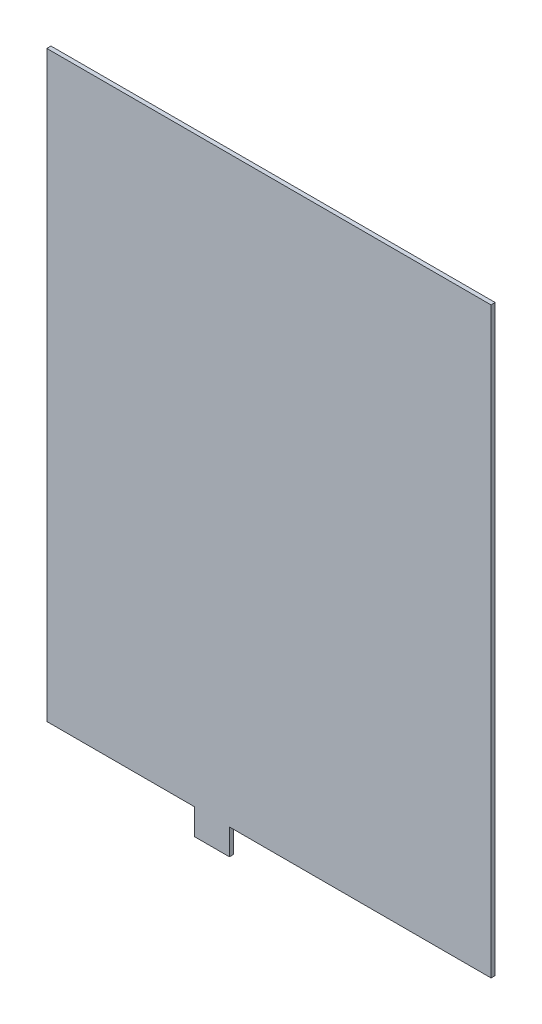
ISO-10303-21;
HEADER;
FILE_DESCRIPTION(('STEP AP214'),'2;1');
FILE_NAME('part.step','',(''),(''),'','','');
FILE_SCHEMA(('AUTOMOTIVE_DESIGN { 1 0 10303 214 1 1 1 1 }'));
ENDSEC;
DATA;
#1=APPLICATION_CONTEXT('core data for automotive mechanical design processes');
#2=APPLICATION_PROTOCOL_DEFINITION('international standard','automotive_design',2000,#1);
#3=PRODUCT_CONTEXT('',#1,'mechanical');
#4=PRODUCT('Part','Part','',(#3));
#5=PRODUCT_RELATED_PRODUCT_CATEGORY('part','',(#4));
#6=PRODUCT_DEFINITION_FORMATION('','',#4);
#7=PRODUCT_DEFINITION_CONTEXT('part definition',#1,'design');
#8=PRODUCT_DEFINITION('design','',#6,#7);
#9=PRODUCT_DEFINITION_SHAPE('','',#8);
#10=(LENGTH_UNIT() NAMED_UNIT(*) SI_UNIT(.MILLI.,.METRE.));
#11=(NAMED_UNIT(*) PLANE_ANGLE_UNIT() SI_UNIT($,.RADIAN.));
#12=(NAMED_UNIT(*) SI_UNIT($,.STERADIAN.) SOLID_ANGLE_UNIT());
#13=UNCERTAINTY_MEASURE_WITH_UNIT(LENGTH_MEASURE(1.E-05),#10,'distance_accuracy_value','');
#14=(GEOMETRIC_REPRESENTATION_CONTEXT(3) GLOBAL_UNCERTAINTY_ASSIGNED_CONTEXT((#13)) GLOBAL_UNIT_ASSIGNED_CONTEXT((#10,
#11,#12)) REPRESENTATION_CONTEXT('',''));
#15=CARTESIAN_POINT('',(0.,0.,0.));
#16=DIRECTION('',(0.,0.,1.));
#17=DIRECTION('',(1.,0.,0.));
#18=AXIS2_PLACEMENT_3D('',#15,#16,#17);
#19=CARTESIAN_POINT('',(-85.75,0.,1.6));
#20=DIRECTION('',(-1.,0.,0.));
#21=DIRECTION('',(0.,0.,1.));
#22=AXIS2_PLACEMENT_3D('',#19,#20,#21);
#23=PLANE('',#22);
#24=DIRECTION('',(0.,1.,0.));
#25=VECTOR('',#24,1.);
#26=CARTESIAN_POINT('',(-85.75,0.,0.));
#27=LINE('',#26,#25);
#28=CARTESIAN_POINT('',(-85.75,-112.5,0.));
#29=VERTEX_POINT('',#28);
#30=CARTESIAN_POINT('',(-85.75,112.5,0.));
#31=VERTEX_POINT('',#30);
#32=EDGE_CURVE('E162',#29,#31,#27,.T.);
#33=ORIENTED_EDGE('',*,*,#32,.F.);
#34=DIRECTION('',(0.,0.,-1.));
#35=VECTOR('',#34,1.);
#36=CARTESIAN_POINT('',(-85.75,-112.5,1.6));
#37=LINE('',#36,#35);
#38=CARTESIAN_POINT('',(-85.75,-112.5,1.6));
#39=VERTEX_POINT('',#38);
#40=EDGE_CURVE('E11',#39,#29,#37,.T.);
#41=ORIENTED_EDGE('',*,*,#40,.F.);
#42=DIRECTION('',(0.,1.,0.));
#43=VECTOR('',#42,1.);
#44=CARTESIAN_POINT('',(-85.75,0.,1.6));
#45=LINE('',#44,#43);
#46=CARTESIAN_POINT('',(-85.75,112.5,1.6));
#47=VERTEX_POINT('',#46);
#48=EDGE_CURVE('E127',#39,#47,#45,.T.);
#49=ORIENTED_EDGE('',*,*,#48,.T.);
#50=DIRECTION('',(0.,0.,-1.));
#51=VECTOR('',#50,1.);
#52=CARTESIAN_POINT('',(-85.75,112.5,1.6));
#53=LINE('',#52,#51);
#54=EDGE_CURVE('E82',#47,#31,#53,.T.);
#55=ORIENTED_EDGE('',*,*,#54,.T.);
#56=EDGE_LOOP('',(#33,#41,#49,#55));
#57=FACE_BOUND('',#56,.T.);
#58=ADVANCED_FACE('F32',(#57),#23,.T.);
#59=CARTESIAN_POINT('',(0.,-112.5,1.6));
#60=DIRECTION('',(0.,-1.,0.));
#61=DIRECTION('',(1.,0.,0.));
#62=AXIS2_PLACEMENT_3D('',#59,#60,#61);
#63=PLANE('',#62);
#64=DIRECTION('',(-1.,0.,0.));
#65=VECTOR('',#64,1.);
#66=CARTESIAN_POINT('',(0.,-112.5,0.));
#67=LINE('',#66,#65);
#68=CARTESIAN_POINT('',(-28.75,-112.5,0.));
#69=VERTEX_POINT('',#68);
#70=EDGE_CURVE('E157',#69,#29,#67,.T.);
#71=ORIENTED_EDGE('',*,*,#70,.F.);
#72=DIRECTION('',(0.,0.,-1.));
#73=VECTOR('',#72,1.);
#74=CARTESIAN_POINT('',(-28.75,-112.5,1.6));
#75=LINE('',#74,#73);
#76=CARTESIAN_POINT('',(-28.75,-112.5,1.6));
#77=VERTEX_POINT('',#76);
#78=EDGE_CURVE('E40',#77,#69,#75,.T.);
#79=ORIENTED_EDGE('',*,*,#78,.F.);
#80=DIRECTION('',(-1.,0.,0.));
#81=VECTOR('',#80,1.);
#82=CARTESIAN_POINT('',(0.,-112.5,1.6));
#83=LINE('',#82,#81);
#84=EDGE_CURVE('E120',#77,#39,#83,.T.);
#85=ORIENTED_EDGE('',*,*,#84,.T.);
#86=ORIENTED_EDGE('',*,*,#40,.T.);
#87=EDGE_LOOP('',(#71,#79,#85,#86));
#88=FACE_BOUND('',#87,.T.);
#89=ADVANCED_FACE('F161',(#88),#63,.T.);
#90=CARTESIAN_POINT('',(-28.75,0.,1.6));
#91=DIRECTION('',(1.,0.,0.));
#92=DIRECTION('',(0.,0.,-1.));
#93=AXIS2_PLACEMENT_3D('',#90,#91,#92);
#94=PLANE('',#93);
#95=DIRECTION('',(0.,-1.,0.));
#96=VECTOR('',#95,1.);
#97=CARTESIAN_POINT('',(-28.75,0.,0.));
#98=LINE('',#97,#96);
#99=CARTESIAN_POINT('',(-28.75,-122.5,0.));
#100=VERTEX_POINT('',#99);
#101=EDGE_CURVE('E151',#69,#100,#98,.T.);
#102=ORIENTED_EDGE('',*,*,#101,.T.);
#103=DIRECTION('',(0.,0.,-1.));
#104=VECTOR('',#103,1.);
#105=CARTESIAN_POINT('',(-28.75,-122.5,1.6));
#106=LINE('',#105,#104);
#107=CARTESIAN_POINT('',(-28.75,-122.5,1.6));
#108=VERTEX_POINT('',#107);
#109=EDGE_CURVE('E144',#108,#100,#106,.T.);
#110=ORIENTED_EDGE('',*,*,#109,.F.);
#111=DIRECTION('',(0.,-1.,0.));
#112=VECTOR('',#111,1.);
#113=CARTESIAN_POINT('',(-28.75,0.,1.6));
#114=LINE('',#113,#112);
#115=EDGE_CURVE('E126',#77,#108,#114,.T.);
#116=ORIENTED_EDGE('',*,*,#115,.F.);
#117=ORIENTED_EDGE('',*,*,#78,.T.);
#118=EDGE_LOOP('',(#102,#110,#116,#117));
#119=FACE_BOUND('',#118,.T.);
#120=ADVANCED_FACE('F149',(#119),#94,.F.);
#121=CARTESIAN_POINT('',(0.,-122.5,1.6));
#122=DIRECTION('',(0.,1.,0.));
#123=DIRECTION('',(0.,0.,1.));
#124=AXIS2_PLACEMENT_3D('',#121,#122,#123);
#125=PLANE('',#124);
#126=DIRECTION('',(1.,0.,0.));
#127=VECTOR('',#126,1.);
#128=CARTESIAN_POINT('',(0.,-122.5,0.));
#129=LINE('',#128,#127);
#130=CARTESIAN_POINT('',(-15.25,-122.5,0.));
#131=VERTEX_POINT('',#130);
#132=EDGE_CURVE('E159',#100,#131,#129,.T.);
#133=ORIENTED_EDGE('',*,*,#132,.T.);
#134=DIRECTION('',(0.,0.,-1.));
#135=VECTOR('',#134,1.);
#136=CARTESIAN_POINT('',(-15.25,-122.5,1.6));
#137=LINE('',#136,#135);
#138=CARTESIAN_POINT('',(-15.25,-122.5,1.6));
#139=VERTEX_POINT('',#138);
#140=EDGE_CURVE('E141',#139,#131,#137,.T.);
#141=ORIENTED_EDGE('',*,*,#140,.F.);
#142=DIRECTION('',(1.,0.,0.));
#143=VECTOR('',#142,1.);
#144=CARTESIAN_POINT('',(0.,-122.5,1.6));
#145=LINE('',#144,#143);
#146=EDGE_CURVE('E121',#108,#139,#145,.T.);
#147=ORIENTED_EDGE('',*,*,#146,.F.);
#148=ORIENTED_EDGE('',*,*,#109,.T.);
#149=EDGE_LOOP('',(#133,#141,#147,#148));
#150=FACE_BOUND('',#149,.T.);
#151=ADVANCED_FACE('F171',(#150),#125,.F.);
#152=CARTESIAN_POINT('',(-15.25,0.,1.6));
#153=DIRECTION('',(-1.,0.,0.));
#154=DIRECTION('',(0.,0.,1.));
#155=AXIS2_PLACEMENT_3D('',#152,#153,#154);
#156=PLANE('',#155);
#157=DIRECTION('',(0.,1.,0.));
#158=VECTOR('',#157,1.);
#159=CARTESIAN_POINT('',(-15.25,0.,0.));
#160=LINE('',#159,#158);
#161=CARTESIAN_POINT('',(-15.25,-112.5,0.));
#162=VERTEX_POINT('',#161);
#163=EDGE_CURVE('E165',#131,#162,#160,.T.);
#164=ORIENTED_EDGE('',*,*,#163,.T.);
#165=DIRECTION('',(0.,0.,-1.));
#166=VECTOR('',#165,1.);
#167=CARTESIAN_POINT('',(-15.25,-112.5,1.6));
#168=LINE('',#167,#166);
#169=CARTESIAN_POINT('',(-15.25,-112.5,1.6));
#170=VERTEX_POINT('',#169);
#171=EDGE_CURVE('E109',#170,#162,#168,.T.);
#172=ORIENTED_EDGE('',*,*,#171,.F.);
#173=DIRECTION('',(0.,1.,0.));
#174=VECTOR('',#173,1.);
#175=CARTESIAN_POINT('',(-15.25,0.,1.6));
#176=LINE('',#175,#174);
#177=EDGE_CURVE('E117',#139,#170,#176,.T.);
#178=ORIENTED_EDGE('',*,*,#177,.F.);
#179=ORIENTED_EDGE('',*,*,#140,.T.);
#180=EDGE_LOOP('',(#164,#172,#178,#179));
#181=FACE_BOUND('',#180,.T.);
#182=ADVANCED_FACE('F173',(#181),#156,.F.);
#183=CARTESIAN_POINT('',(85.75,-112.5,0.));
#184=VERTEX_POINT('',#183);
#185=EDGE_CURVE('E108',#184,#162,#67,.T.);
#186=ORIENTED_EDGE('',*,*,#185,.F.);
#187=DIRECTION('',(0.,0.,-1.));
#188=VECTOR('',#187,1.);
#189=CARTESIAN_POINT('',(85.75,-112.5,1.6));
#190=LINE('',#189,#188);
#191=CARTESIAN_POINT('',(85.75,-112.5,1.6));
#192=VERTEX_POINT('',#191);
#193=EDGE_CURVE('E102',#192,#184,#190,.T.);
#194=ORIENTED_EDGE('',*,*,#193,.F.);
#195=EDGE_CURVE('E106',#192,#170,#83,.T.);
#196=ORIENTED_EDGE('',*,*,#195,.T.);
#197=ORIENTED_EDGE('',*,*,#171,.T.);
#198=EDGE_LOOP('',(#186,#194,#196,#197));
#199=FACE_BOUND('',#198,.T.);
#200=ADVANCED_FACE('F104',(#199),#63,.T.);
#201=CARTESIAN_POINT('',(85.75,0.,1.6));
#202=DIRECTION('',(-1.,0.,0.));
#203=DIRECTION('',(0.,0.,1.));
#204=AXIS2_PLACEMENT_3D('',#201,#202,#203);
#205=PLANE('',#204);
#206=DIRECTION('',(0.,1.,0.));
#207=VECTOR('',#206,1.);
#208=CARTESIAN_POINT('',(85.75,0.,0.));
#209=LINE('',#208,#207);
#210=CARTESIAN_POINT('',(85.75,112.5,0.));
#211=VERTEX_POINT('',#210);
#212=EDGE_CURVE('E75',#184,#211,#209,.T.);
#213=ORIENTED_EDGE('',*,*,#212,.T.);
#214=DIRECTION('',(0.,0.,-1.));
#215=VECTOR('',#214,1.);
#216=CARTESIAN_POINT('',(85.75,112.5,1.6));
#217=LINE('',#216,#215);
#218=CARTESIAN_POINT('',(85.75,112.5,1.6));
#219=VERTEX_POINT('',#218);
#220=EDGE_CURVE('E110',#219,#211,#217,.T.);
#221=ORIENTED_EDGE('',*,*,#220,.F.);
#222=DIRECTION('',(0.,1.,0.));
#223=VECTOR('',#222,1.);
#224=CARTESIAN_POINT('',(85.75,0.,1.6));
#225=LINE('',#224,#223);
#226=EDGE_CURVE('E112',#192,#219,#225,.T.);
#227=ORIENTED_EDGE('',*,*,#226,.F.);
#228=ORIENTED_EDGE('',*,*,#193,.T.);
#229=EDGE_LOOP('',(#213,#221,#227,#228));
#230=FACE_BOUND('',#229,.T.);
#231=ADVANCED_FACE('F113',(#230),#205,.F.);
#232=CARTESIAN_POINT('',(0.,112.5,1.6));
#233=DIRECTION('',(0.,-1.,0.));
#234=DIRECTION('',(1.,0.,0.));
#235=AXIS2_PLACEMENT_3D('',#232,#233,#234);
#236=PLANE('',#235);
#237=DIRECTION('',(-1.,0.,0.));
#238=VECTOR('',#237,1.);
#239=CARTESIAN_POINT('',(0.,112.5,0.));
#240=LINE('',#239,#238);
#241=EDGE_CURVE('E130',#211,#31,#240,.T.);
#242=ORIENTED_EDGE('',*,*,#241,.T.);
#243=ORIENTED_EDGE('',*,*,#54,.F.);
#244=DIRECTION('',(-1.,0.,0.));
#245=VECTOR('',#244,1.);
#246=CARTESIAN_POINT('',(0.,112.5,1.6));
#247=LINE('',#246,#245);
#248=EDGE_CURVE('E48',#219,#47,#247,.T.);
#249=ORIENTED_EDGE('',*,*,#248,.F.);
#250=ORIENTED_EDGE('',*,*,#220,.T.);
#251=EDGE_LOOP('',(#242,#243,#249,#250));
#252=FACE_BOUND('',#251,.T.);
#253=ADVANCED_FACE('F192',(#252),#236,.F.);
#254=CARTESIAN_POINT('',(0.,0.,1.6));
#255=DIRECTION('',(0.,0.,1.));
#256=DIRECTION('',(1.,0.,0.));
#257=AXIS2_PLACEMENT_3D('',#254,#255,#256);
#258=PLANE('',#257);
#259=ORIENTED_EDGE('',*,*,#48,.F.);
#260=ORIENTED_EDGE('',*,*,#84,.F.);
#261=ORIENTED_EDGE('',*,*,#115,.T.);
#262=ORIENTED_EDGE('',*,*,#146,.T.);
#263=ORIENTED_EDGE('',*,*,#177,.T.);
#264=ORIENTED_EDGE('',*,*,#195,.F.);
#265=ORIENTED_EDGE('',*,*,#226,.T.);
#266=ORIENTED_EDGE('',*,*,#248,.T.);
#267=EDGE_LOOP('',(#259,#260,#261,#262,#263,#264,#265,#266));
#268=FACE_BOUND('',#267,.T.);
#269=ADVANCED_FACE('F115',(#268),#258,.T.);
#270=CARTESIAN_POINT('',(0.,0.,0.));
#271=DIRECTION('',(0.,0.,1.));
#272=DIRECTION('',(1.,0.,0.));
#273=AXIS2_PLACEMENT_3D('',#270,#271,#272);
#274=PLANE('',#273);
#275=ORIENTED_EDGE('',*,*,#32,.T.);
#276=ORIENTED_EDGE('',*,*,#241,.F.);
#277=ORIENTED_EDGE('',*,*,#212,.F.);
#278=ORIENTED_EDGE('',*,*,#185,.T.);
#279=ORIENTED_EDGE('',*,*,#163,.F.);
#280=ORIENTED_EDGE('',*,*,#132,.F.);
#281=ORIENTED_EDGE('',*,*,#101,.F.);
#282=ORIENTED_EDGE('',*,*,#70,.T.);
#283=EDGE_LOOP('',(#275,#276,#277,#278,#279,#280,#281,#282));
#284=FACE_BOUND('',#283,.T.);
#285=ADVANCED_FACE('F156',(#284),#274,.F.);
#286=CLOSED_SHELL('',(#58,#89,#120,#151,#182,#200,#231,#253,#269,#285));
#287=MANIFOLD_SOLID_BREP('B2',#286);
#288=ADVANCED_BREP_SHAPE_REPRESENTATION('',(#18,#287),#14);
#289=SHAPE_DEFINITION_REPRESENTATION(#9,#288);
ENDSEC;
END-ISO-10303-21;
